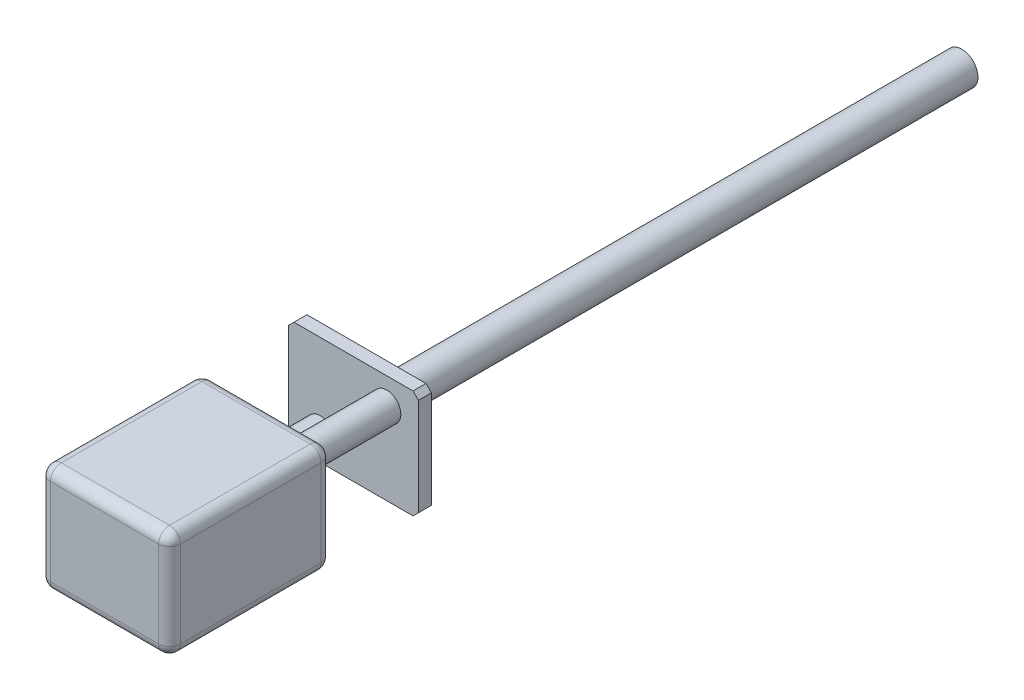
ISO-10303-21;
HEADER;
FILE_DESCRIPTION(('STEP AP214'),'2;1');
FILE_NAME('part.step','',(''),(''),'','','');
FILE_SCHEMA(('AUTOMOTIVE_DESIGN { 1 0 10303 214 1 1 1 1 }'));
ENDSEC;
DATA;
#1=APPLICATION_CONTEXT('core data for automotive mechanical design processes');
#2=APPLICATION_PROTOCOL_DEFINITION('international standard','automotive_design',2000,#1);
#3=PRODUCT_CONTEXT('',#1,'mechanical');
#4=PRODUCT('Part','Part','',(#3));
#5=PRODUCT_RELATED_PRODUCT_CATEGORY('part','',(#4));
#6=PRODUCT_DEFINITION_FORMATION('','',#4);
#7=PRODUCT_DEFINITION_CONTEXT('part definition',#1,'design');
#8=PRODUCT_DEFINITION('design','',#6,#7);
#9=PRODUCT_DEFINITION_SHAPE('','',#8);
#10=(LENGTH_UNIT() NAMED_UNIT(*) SI_UNIT(.MILLI.,.METRE.));
#11=(NAMED_UNIT(*) PLANE_ANGLE_UNIT() SI_UNIT($,.RADIAN.));
#12=(NAMED_UNIT(*) SI_UNIT($,.STERADIAN.) SOLID_ANGLE_UNIT());
#13=UNCERTAINTY_MEASURE_WITH_UNIT(LENGTH_MEASURE(1.E-05),#10,'distance_accuracy_value','');
#14=(GEOMETRIC_REPRESENTATION_CONTEXT(3) GLOBAL_UNCERTAINTY_ASSIGNED_CONTEXT((#13)) GLOBAL_UNIT_ASSIGNED_CONTEXT((#10,
#11,#12)) REPRESENTATION_CONTEXT('',''));
#15=CARTESIAN_POINT('',(0.,0.,0.));
#16=DIRECTION('',(0.,0.,1.));
#17=DIRECTION('',(1.,0.,0.));
#18=AXIS2_PLACEMENT_3D('',#15,#16,#17);
#19=CARTESIAN_POINT('',(0.,0.,15.));
#20=DIRECTION('',(1.,0.,0.));
#21=DIRECTION('',(0.,0.,-1.));
#22=AXIS2_PLACEMENT_3D('',#19,#20,#21);
#23=PLANE('',#22);
#24=DIRECTION('',(0.,-1.,0.));
#25=VECTOR('',#24,1.);
#26=CARTESIAN_POINT('',(0.,0.,1.));
#27=LINE('',#26,#25);
#28=CARTESIAN_POINT('',(0.,9.,1.));
#29=VERTEX_POINT('',#28);
#30=CARTESIAN_POINT('',(0.,1.,1.));
#31=VERTEX_POINT('',#30);
#32=EDGE_CURVE('E279',#29,#31,#27,.T.);
#33=ORIENTED_EDGE('',*,*,#32,.T.);
#34=DIRECTION('',(0.,0.,-1.));
#35=VECTOR('',#34,1.);
#36=CARTESIAN_POINT('',(0.,1.,15.));
#37=LINE('',#36,#35);
#38=CARTESIAN_POINT('',(0.,1.,14.));
#39=VERTEX_POINT('',#38);
#40=EDGE_CURVE('E283',#31,#39,#37,.F.);
#41=ORIENTED_EDGE('',*,*,#40,.T.);
#42=DIRECTION('',(0.,-1.,0.));
#43=VECTOR('',#42,1.);
#44=CARTESIAN_POINT('',(0.,0.,14.));
#45=LINE('',#44,#43);
#46=CARTESIAN_POINT('',(0.,9.,14.));
#47=VERTEX_POINT('',#46);
#48=EDGE_CURVE('E276',#39,#47,#45,.F.);
#49=ORIENTED_EDGE('',*,*,#48,.T.);
#50=DIRECTION('',(0.,0.,-1.));
#51=VECTOR('',#50,1.);
#52=CARTESIAN_POINT('',(0.,9.,15.));
#53=LINE('',#52,#51);
#54=EDGE_CURVE('E273',#47,#29,#53,.T.);
#55=ORIENTED_EDGE('',*,*,#54,.T.);
#56=EDGE_LOOP('',(#33,#41,#49,#55));
#57=FACE_BOUND('',#56,.T.);
#58=ADVANCED_FACE('F41',(#57),#23,.F.);
#59=CARTESIAN_POINT('',(0.,0.,15.));
#60=DIRECTION('',(0.,1.,0.));
#61=DIRECTION('',(0.,0.,1.));
#62=AXIS2_PLACEMENT_3D('',#59,#60,#61);
#63=PLANE('',#62);
#64=DIRECTION('',(1.,0.,0.));
#65=VECTOR('',#64,1.);
#66=CARTESIAN_POINT('',(12.,0.,1.));
#67=LINE('',#66,#65);
#68=CARTESIAN_POINT('',(1.,0.,1.));
#69=VERTEX_POINT('',#68);
#70=CARTESIAN_POINT('',(11.,0.,1.));
#71=VERTEX_POINT('',#70);
#72=EDGE_CURVE('E266',#69,#71,#67,.T.);
#73=ORIENTED_EDGE('',*,*,#72,.T.);
#74=DIRECTION('',(0.,0.,-1.));
#75=VECTOR('',#74,1.);
#76=CARTESIAN_POINT('',(11.,0.,15.));
#77=LINE('',#76,#75);
#78=CARTESIAN_POINT('',(11.,0.,14.));
#79=VERTEX_POINT('',#78);
#80=EDGE_CURVE('E270',#71,#79,#77,.F.);
#81=ORIENTED_EDGE('',*,*,#80,.T.);
#82=DIRECTION('',(1.,0.,0.));
#83=VECTOR('',#82,1.);
#84=CARTESIAN_POINT('',(0.,0.,14.));
#85=LINE('',#84,#83);
#86=CARTESIAN_POINT('',(1.,0.,14.));
#87=VERTEX_POINT('',#86);
#88=EDGE_CURVE('E263',#79,#87,#85,.F.);
#89=ORIENTED_EDGE('',*,*,#88,.T.);
#90=DIRECTION('',(0.,0.,-1.));
#91=VECTOR('',#90,1.);
#92=CARTESIAN_POINT('',(1.,0.,15.));
#93=LINE('',#92,#91);
#94=EDGE_CURVE('E260',#87,#69,#93,.T.);
#95=ORIENTED_EDGE('',*,*,#94,.T.);
#96=EDGE_LOOP('',(#73,#81,#89,#95));
#97=FACE_BOUND('',#96,.T.);
#98=ADVANCED_FACE('F424',(#97),#63,.F.);
#99=CARTESIAN_POINT('',(12.,0.,15.));
#100=DIRECTION('',(-1.,0.,0.));
#101=DIRECTION('',(0.,0.,1.));
#102=AXIS2_PLACEMENT_3D('',#99,#100,#101);
#103=PLANE('',#102);
#104=DIRECTION('',(0.,1.,0.));
#105=VECTOR('',#104,1.);
#106=CARTESIAN_POINT('',(12.,0.,14.));
#107=LINE('',#106,#105);
#108=CARTESIAN_POINT('',(12.,9.,14.));
#109=VERTEX_POINT('',#108);
#110=CARTESIAN_POINT('',(12.,1.,14.));
#111=VERTEX_POINT('',#110);
#112=EDGE_CURVE('E236',#109,#111,#107,.F.);
#113=ORIENTED_EDGE('',*,*,#112,.T.);
#114=DIRECTION('',(0.,0.,-1.));
#115=VECTOR('',#114,1.);
#116=CARTESIAN_POINT('',(12.,1.,15.));
#117=LINE('',#116,#115);
#118=CARTESIAN_POINT('',(12.,1.,1.));
#119=VERTEX_POINT('',#118);
#120=EDGE_CURVE('E244',#111,#119,#117,.T.);
#121=ORIENTED_EDGE('',*,*,#120,.T.);
#122=DIRECTION('',(0.,1.,0.));
#123=VECTOR('',#122,1.);
#124=CARTESIAN_POINT('',(12.,10.,1.));
#125=LINE('',#124,#123);
#126=CARTESIAN_POINT('',(12.,9.,1.));
#127=VERTEX_POINT('',#126);
#128=EDGE_CURVE('E240',#119,#127,#125,.T.);
#129=ORIENTED_EDGE('',*,*,#128,.T.);
#130=DIRECTION('',(0.,0.,-1.));
#131=VECTOR('',#130,1.);
#132=CARTESIAN_POINT('',(12.,9.,15.));
#133=LINE('',#132,#131);
#134=EDGE_CURVE('E233',#127,#109,#133,.F.);
#135=ORIENTED_EDGE('',*,*,#134,.T.);
#136=EDGE_LOOP('',(#113,#121,#129,#135));
#137=FACE_BOUND('',#136,.T.);
#138=ADVANCED_FACE('F430',(#137),#103,.F.);
#139=CARTESIAN_POINT('',(0.,10.,15.));
#140=DIRECTION('',(0.,-1.,0.));
#141=DIRECTION('',(0.,0.,-1.));
#142=AXIS2_PLACEMENT_3D('',#139,#140,#141);
#143=PLANE('',#142);
#144=DIRECTION('',(-1.,0.,0.));
#145=VECTOR('',#144,1.);
#146=CARTESIAN_POINT('',(0.,10.,1.));
#147=LINE('',#146,#145);
#148=CARTESIAN_POINT('',(11.,10.,1.));
#149=VERTEX_POINT('',#148);
#150=CARTESIAN_POINT('',(1.,10.,1.));
#151=VERTEX_POINT('',#150);
#152=EDGE_CURVE('E292',#149,#151,#147,.T.);
#153=ORIENTED_EDGE('',*,*,#152,.T.);
#154=DIRECTION('',(0.,0.,-1.));
#155=VECTOR('',#154,1.);
#156=CARTESIAN_POINT('',(1.,10.,15.));
#157=LINE('',#156,#155);
#158=CARTESIAN_POINT('',(1.,10.,14.));
#159=VERTEX_POINT('',#158);
#160=EDGE_CURVE('E296',#151,#159,#157,.F.);
#161=ORIENTED_EDGE('',*,*,#160,.T.);
#162=DIRECTION('',(-1.,0.,0.));
#163=VECTOR('',#162,1.);
#164=CARTESIAN_POINT('',(0.,10.,14.));
#165=LINE('',#164,#163);
#166=CARTESIAN_POINT('',(11.,10.,14.));
#167=VERTEX_POINT('',#166);
#168=EDGE_CURVE('E289',#159,#167,#165,.F.);
#169=ORIENTED_EDGE('',*,*,#168,.T.);
#170=DIRECTION('',(0.,0.,-1.));
#171=VECTOR('',#170,1.);
#172=CARTESIAN_POINT('',(11.,10.,15.));
#173=LINE('',#172,#171);
#174=EDGE_CURVE('E286',#167,#149,#173,.T.);
#175=ORIENTED_EDGE('',*,*,#174,.T.);
#176=EDGE_LOOP('',(#153,#161,#169,#175));
#177=FACE_BOUND('',#176,.T.);
#178=ADVANCED_FACE('F546',(#177),#143,.F.);
#179=CARTESIAN_POINT('',(0.,0.,15.));
#180=DIRECTION('',(0.,0.,-1.));
#181=DIRECTION('',(-1.,0.,0.));
#182=AXIS2_PLACEMENT_3D('',#179,#180,#181);
#183=PLANE('',#182);
#184=DIRECTION('',(1.,0.,0.));
#185=VECTOR('',#184,1.);
#186=CARTESIAN_POINT('',(0.,1.,15.));
#187=LINE('',#186,#185);
#188=CARTESIAN_POINT('',(1.,1.,15.));
#189=VERTEX_POINT('',#188);
#190=CARTESIAN_POINT('',(11.,1.,15.));
#191=VERTEX_POINT('',#190);
#192=EDGE_CURVE('E299',#189,#191,#187,.T.);
#193=ORIENTED_EDGE('',*,*,#192,.T.);
#194=DIRECTION('',(0.,1.,0.));
#195=VECTOR('',#194,1.);
#196=CARTESIAN_POINT('',(11.,0.,15.));
#197=LINE('',#196,#195);
#198=CARTESIAN_POINT('',(11.,9.,15.));
#199=VERTEX_POINT('',#198);
#200=EDGE_CURVE('E307',#191,#199,#197,.T.);
#201=ORIENTED_EDGE('',*,*,#200,.T.);
#202=DIRECTION('',(-1.,0.,0.));
#203=VECTOR('',#202,1.);
#204=CARTESIAN_POINT('',(0.,9.,15.));
#205=LINE('',#204,#203);
#206=CARTESIAN_POINT('',(1.,9.,15.));
#207=VERTEX_POINT('',#206);
#208=EDGE_CURVE('E65',#199,#207,#205,.T.);
#209=ORIENTED_EDGE('',*,*,#208,.T.);
#210=DIRECTION('',(0.,-1.,0.));
#211=VECTOR('',#210,1.);
#212=CARTESIAN_POINT('',(1.,0.,15.));
#213=LINE('',#212,#211);
#214=EDGE_CURVE('E302',#207,#189,#213,.T.);
#215=ORIENTED_EDGE('',*,*,#214,.T.);
#216=EDGE_LOOP('',(#193,#201,#209,#215));
#217=FACE_BOUND('',#216,.T.);
#218=ADVANCED_FACE('F419',(#217),#183,.F.);
#219=CARTESIAN_POINT('',(0.,0.,0.));
#220=DIRECTION('',(0.,0.,-1.));
#221=DIRECTION('',(-1.,0.,0.));
#222=AXIS2_PLACEMENT_3D('',#219,#220,#221);
#223=PLANE('',#222);
#224=CARTESIAN_POINT('',(9.0728851183895,7.56073759865792,0.));
#225=DIRECTION('',(0.,0.,-1.));
#226=DIRECTION('',(-1.,0.,0.));
#227=AXIS2_PLACEMENT_3D('',#224,#225,#226);
#228=CIRCLE('',#227,1.3);
#229=CARTESIAN_POINT('',(7.7728851183895,7.56073759865792,0.));
#230=VERTEX_POINT('',#229);
#231=EDGE_CURVE('E210',#230,#230,#228,.T.);
#232=ORIENTED_EDGE('',*,*,#231,.F.);
#233=EDGE_LOOP('',(#232));
#234=FACE_BOUND('',#233,.T.);
#235=CARTESIAN_POINT('',(2.9271148816105,2.43926240134208,0.));
#236=DIRECTION('',(0.,0.,-1.));
#237=DIRECTION('',(-1.,0.,0.));
#238=AXIS2_PLACEMENT_3D('',#235,#236,#237);
#239=CIRCLE('',#238,1.3);
#240=CARTESIAN_POINT('',(1.6271148816105,2.43926240134208,0.));
#241=VERTEX_POINT('',#240);
#242=EDGE_CURVE('E223',#241,#241,#239,.T.);
#243=ORIENTED_EDGE('',*,*,#242,.F.);
#244=EDGE_LOOP('',(#243));
#245=FACE_BOUND('',#244,.T.);
#246=DIRECTION('',(-1.,0.,0.));
#247=VECTOR('',#246,1.);
#248=CARTESIAN_POINT('',(12.,9.,0.));
#249=LINE('',#248,#247);
#250=CARTESIAN_POINT('',(1.,9.,0.));
#251=VERTEX_POINT('',#250);
#252=CARTESIAN_POINT('',(11.,9.,0.));
#253=VERTEX_POINT('',#252);
#254=EDGE_CURVE('E247',#251,#253,#249,.F.);
#255=ORIENTED_EDGE('',*,*,#254,.T.);
#256=DIRECTION('',(0.,1.,0.));
#257=VECTOR('',#256,1.);
#258=CARTESIAN_POINT('',(11.,0.,0.));
#259=LINE('',#258,#257);
#260=CARTESIAN_POINT('',(11.,1.,0.));
#261=VERTEX_POINT('',#260);
#262=EDGE_CURVE('E256',#253,#261,#259,.F.);
#263=ORIENTED_EDGE('',*,*,#262,.T.);
#264=DIRECTION('',(1.,0.,0.));
#265=VECTOR('',#264,1.);
#266=CARTESIAN_POINT('',(0.,1.,0.));
#267=LINE('',#266,#265);
#268=CARTESIAN_POINT('',(1.,1.,0.));
#269=VERTEX_POINT('',#268);
#270=EDGE_CURVE('E253',#261,#269,#267,.F.);
#271=ORIENTED_EDGE('',*,*,#270,.T.);
#272=DIRECTION('',(0.,-1.,0.));
#273=VECTOR('',#272,1.);
#274=CARTESIAN_POINT('',(1.,10.,0.));
#275=LINE('',#274,#273);
#276=EDGE_CURVE('E250',#269,#251,#275,.F.);
#277=ORIENTED_EDGE('',*,*,#276,.T.);
#278=EDGE_LOOP('',(#255,#263,#271,#277));
#279=FACE_BOUND('',#278,.T.);
#280=ADVANCED_FACE('F406',(#234,#245,#279),#223,.T.);
#281=CARTESIAN_POINT('',(1.,0.,14.));
#282=DIRECTION('',(0.,-1.,0.));
#283=DIRECTION('',(0.,0.,-1.));
#284=AXIS2_PLACEMENT_3D('',#281,#282,#283);
#285=CYLINDRICAL_SURFACE('',#284,1.);
#286=CARTESIAN_POINT('',(1.,1.,14.));
#287=DIRECTION('',(0.,-1.,0.));
#288=DIRECTION('',(0.,0.,-1.));
#289=AXIS2_PLACEMENT_3D('',#286,#287,#288);
#290=CIRCLE('',#289,1.);
#291=EDGE_CURVE('E237',#189,#39,#290,.T.);
#292=ORIENTED_EDGE('',*,*,#291,.F.);
#293=ORIENTED_EDGE('',*,*,#214,.F.);
#294=CARTESIAN_POINT('',(1.,9.,14.));
#295=DIRECTION('',(0.,1.,0.));
#296=DIRECTION('',(0.,0.,1.));
#297=AXIS2_PLACEMENT_3D('',#294,#295,#296);
#298=CIRCLE('',#297,1.);
#299=EDGE_CURVE('E389',#47,#207,#298,.T.);
#300=ORIENTED_EDGE('',*,*,#299,.F.);
#301=ORIENTED_EDGE('',*,*,#48,.F.);
#302=EDGE_LOOP('',(#292,#293,#300,#301));
#303=FACE_BOUND('',#302,.T.);
#304=ADVANCED_FACE('F43',(#303),#285,.T.);
#305=CARTESIAN_POINT('',(1.,1.,14.));
#306=DIRECTION('',(0.,0.,1.));
#307=DIRECTION('',(1.,0.,0.));
#308=AXIS2_PLACEMENT_3D('',#305,#306,#307);
#309=SPHERICAL_SURFACE('',#308,1.);
#310=CARTESIAN_POINT('',(1.,1.,14.));
#311=DIRECTION('',(-1.,0.,0.));
#312=DIRECTION('',(0.,0.,1.));
#313=AXIS2_PLACEMENT_3D('',#310,#311,#312);
#314=CIRCLE('',#313,1.);
#315=EDGE_CURVE('E381',#189,#87,#314,.F.);
#316=ORIENTED_EDGE('',*,*,#315,.F.);
#317=ORIENTED_EDGE('',*,*,#291,.T.);
#318=CARTESIAN_POINT('',(1.,1.,14.));
#319=DIRECTION('',(0.,0.,1.));
#320=DIRECTION('',(1.,0.,0.));
#321=AXIS2_PLACEMENT_3D('',#318,#319,#320);
#322=CIRCLE('',#321,1.);
#323=EDGE_CURVE('E385',#87,#39,#322,.F.);
#324=ORIENTED_EDGE('',*,*,#323,.F.);
#325=EDGE_LOOP('',(#316,#317,#324));
#326=FACE_BOUND('',#325,.T.);
#327=ADVANCED_FACE('F505',(#326),#309,.T.);
#328=CARTESIAN_POINT('',(1.,9.,14.));
#329=DIRECTION('',(0.,0.,1.));
#330=DIRECTION('',(1.,0.,0.));
#331=AXIS2_PLACEMENT_3D('',#328,#329,#330);
#332=SPHERICAL_SURFACE('',#331,1.);
#333=CARTESIAN_POINT('',(1.,9.,14.));
#334=DIRECTION('',(0.,0.,1.));
#335=DIRECTION('',(1.,0.,0.));
#336=AXIS2_PLACEMENT_3D('',#333,#334,#335);
#337=CIRCLE('',#336,1.);
#338=EDGE_CURVE('E373',#47,#159,#337,.F.);
#339=ORIENTED_EDGE('',*,*,#338,.F.);
#340=ORIENTED_EDGE('',*,*,#299,.T.);
#341=CARTESIAN_POINT('',(1.,9.,14.));
#342=DIRECTION('',(-1.,0.,0.));
#343=DIRECTION('',(0.,0.,1.));
#344=AXIS2_PLACEMENT_3D('',#341,#342,#343);
#345=CIRCLE('',#344,1.);
#346=EDGE_CURVE('E377',#159,#207,#345,.F.);
#347=ORIENTED_EDGE('',*,*,#346,.F.);
#348=EDGE_LOOP('',(#339,#340,#347));
#349=FACE_BOUND('',#348,.T.);
#350=ADVANCED_FACE('F502',(#349),#332,.T.);
#351=CARTESIAN_POINT('',(1.,1.,15.));
#352=DIRECTION('',(0.,0.,-1.));
#353=DIRECTION('',(-1.,0.,0.));
#354=AXIS2_PLACEMENT_3D('',#351,#352,#353);
#355=CYLINDRICAL_SURFACE('',#354,1.);
#356=ORIENTED_EDGE('',*,*,#323,.T.);
#357=ORIENTED_EDGE('',*,*,#40,.F.);
#358=CARTESIAN_POINT('',(1.,1.,1.));
#359=DIRECTION('',(0.,0.,-1.));
#360=DIRECTION('',(-1.,0.,0.));
#361=AXIS2_PLACEMENT_3D('',#358,#359,#360);
#362=CIRCLE('',#361,1.);
#363=EDGE_CURVE('E366',#69,#31,#362,.T.);
#364=ORIENTED_EDGE('',*,*,#363,.F.);
#365=ORIENTED_EDGE('',*,*,#94,.F.);
#366=EDGE_LOOP('',(#356,#357,#364,#365));
#367=FACE_BOUND('',#366,.T.);
#368=ADVANCED_FACE('F498',(#367),#355,.T.);
#369=CARTESIAN_POINT('',(0.,1.,14.));
#370=DIRECTION('',(1.,0.,0.));
#371=DIRECTION('',(0.,0.,-1.));
#372=AXIS2_PLACEMENT_3D('',#369,#370,#371);
#373=CYLINDRICAL_SURFACE('',#372,1.);
#374=ORIENTED_EDGE('',*,*,#315,.T.);
#375=ORIENTED_EDGE('',*,*,#88,.F.);
#376=CARTESIAN_POINT('',(11.,1.,14.));
#377=DIRECTION('',(1.,0.,0.));
#378=DIRECTION('',(0.,0.,-1.));
#379=AXIS2_PLACEMENT_3D('',#376,#377,#378);
#380=CIRCLE('',#379,1.);
#381=EDGE_CURVE('E362',#191,#79,#380,.T.);
#382=ORIENTED_EDGE('',*,*,#381,.F.);
#383=ORIENTED_EDGE('',*,*,#192,.F.);
#384=EDGE_LOOP('',(#374,#375,#382,#383));
#385=FACE_BOUND('',#384,.T.);
#386=ADVANCED_FACE('F494',(#385),#373,.T.);
#387=CARTESIAN_POINT('',(11.,0.,14.));
#388=DIRECTION('',(0.,1.,0.));
#389=DIRECTION('',(0.,0.,1.));
#390=AXIS2_PLACEMENT_3D('',#387,#388,#389);
#391=CYLINDRICAL_SURFACE('',#390,1.);
#392=CARTESIAN_POINT('',(11.,9.,14.));
#393=DIRECTION('',(0.,1.,0.));
#394=DIRECTION('',(0.,0.,1.));
#395=AXIS2_PLACEMENT_3D('',#392,#393,#394);
#396=CIRCLE('',#395,1.);
#397=EDGE_CURVE('E355',#199,#109,#396,.T.);
#398=ORIENTED_EDGE('',*,*,#397,.F.);
#399=ORIENTED_EDGE('',*,*,#200,.F.);
#400=CARTESIAN_POINT('',(11.,1.,14.));
#401=DIRECTION('',(0.,-1.,0.));
#402=DIRECTION('',(0.,0.,-1.));
#403=AXIS2_PLACEMENT_3D('',#400,#401,#402);
#404=CIRCLE('',#403,1.);
#405=EDGE_CURVE('E358',#111,#191,#404,.T.);
#406=ORIENTED_EDGE('',*,*,#405,.F.);
#407=ORIENTED_EDGE('',*,*,#112,.F.);
#408=EDGE_LOOP('',(#398,#399,#406,#407));
#409=FACE_BOUND('',#408,.T.);
#410=ADVANCED_FACE('F490',(#409),#391,.T.);
#411=CARTESIAN_POINT('',(0.,9.,14.));
#412=DIRECTION('',(-1.,0.,0.));
#413=DIRECTION('',(0.,0.,1.));
#414=AXIS2_PLACEMENT_3D('',#411,#412,#413);
#415=CYLINDRICAL_SURFACE('',#414,1.);
#416=ORIENTED_EDGE('',*,*,#346,.T.);
#417=ORIENTED_EDGE('',*,*,#208,.F.);
#418=CARTESIAN_POINT('',(11.,9.,14.));
#419=DIRECTION('',(1.,0.,0.));
#420=DIRECTION('',(0.,0.,-1.));
#421=AXIS2_PLACEMENT_3D('',#418,#419,#420);
#422=CIRCLE('',#421,1.);
#423=EDGE_CURVE('E57',#167,#199,#422,.T.);
#424=ORIENTED_EDGE('',*,*,#423,.F.);
#425=ORIENTED_EDGE('',*,*,#168,.F.);
#426=EDGE_LOOP('',(#416,#417,#424,#425));
#427=FACE_BOUND('',#426,.T.);
#428=ADVANCED_FACE('F486',(#427),#415,.T.);
#429=CARTESIAN_POINT('',(1.,9.,15.));
#430=DIRECTION('',(0.,0.,-1.));
#431=DIRECTION('',(-1.,0.,0.));
#432=AXIS2_PLACEMENT_3D('',#429,#430,#431);
#433=CYLINDRICAL_SURFACE('',#432,1.);
#434=ORIENTED_EDGE('',*,*,#338,.T.);
#435=ORIENTED_EDGE('',*,*,#160,.F.);
#436=CARTESIAN_POINT('',(1.,9.,1.));
#437=DIRECTION('',(0.,0.,-1.));
#438=DIRECTION('',(-1.,0.,0.));
#439=AXIS2_PLACEMENT_3D('',#436,#437,#438);
#440=CIRCLE('',#439,1.);
#441=EDGE_CURVE('E349',#29,#151,#440,.T.);
#442=ORIENTED_EDGE('',*,*,#441,.F.);
#443=ORIENTED_EDGE('',*,*,#54,.F.);
#444=EDGE_LOOP('',(#434,#435,#442,#443));
#445=FACE_BOUND('',#444,.T.);
#446=ADVANCED_FACE('F482',(#445),#433,.T.);
#447=CARTESIAN_POINT('',(1.,0.,1.));
#448=DIRECTION('',(0.,1.,0.));
#449=DIRECTION('',(0.,0.,1.));
#450=AXIS2_PLACEMENT_3D('',#447,#448,#449);
#451=CYLINDRICAL_SURFACE('',#450,1.);
#452=CARTESIAN_POINT('',(1.,1.,1.));
#453=DIRECTION('',(0.,-1.,0.));
#454=DIRECTION('',(0.,0.,-1.));
#455=AXIS2_PLACEMENT_3D('',#452,#453,#454);
#456=CIRCLE('',#455,1.);
#457=EDGE_CURVE('E369',#31,#269,#456,.T.);
#458=ORIENTED_EDGE('',*,*,#457,.F.);
#459=ORIENTED_EDGE('',*,*,#32,.F.);
#460=CARTESIAN_POINT('',(1.,9.,1.));
#461=DIRECTION('',(0.,1.,0.));
#462=DIRECTION('',(0.,0.,1.));
#463=AXIS2_PLACEMENT_3D('',#460,#461,#462);
#464=CIRCLE('',#463,1.);
#465=EDGE_CURVE('E345',#251,#29,#464,.T.);
#466=ORIENTED_EDGE('',*,*,#465,.F.);
#467=ORIENTED_EDGE('',*,*,#276,.F.);
#468=EDGE_LOOP('',(#458,#459,#466,#467));
#469=FACE_BOUND('',#468,.T.);
#470=ADVANCED_FACE('F478',(#469),#451,.T.);
#471=CARTESIAN_POINT('',(1.,1.,1.));
#472=DIRECTION('',(0.,0.,1.));
#473=DIRECTION('',(1.,0.,0.));
#474=AXIS2_PLACEMENT_3D('',#471,#472,#473);
#475=SPHERICAL_SURFACE('',#474,1.);
#476=ORIENTED_EDGE('',*,*,#363,.T.);
#477=ORIENTED_EDGE('',*,*,#457,.T.);
#478=CARTESIAN_POINT('',(1.,1.,1.));
#479=DIRECTION('',(-1.,0.,0.));
#480=DIRECTION('',(0.,0.,1.));
#481=AXIS2_PLACEMENT_3D('',#478,#479,#480);
#482=CIRCLE('',#481,1.);
#483=EDGE_CURVE('E341',#69,#269,#482,.F.);
#484=ORIENTED_EDGE('',*,*,#483,.F.);
#485=EDGE_LOOP('',(#476,#477,#484));
#486=FACE_BOUND('',#485,.T.);
#487=ADVANCED_FACE('F474',(#486),#475,.T.);
#488=CARTESIAN_POINT('',(11.,1.,14.));
#489=DIRECTION('',(0.,0.,1.));
#490=DIRECTION('',(1.,0.,0.));
#491=AXIS2_PLACEMENT_3D('',#488,#489,#490);
#492=SPHERICAL_SURFACE('',#491,1.);
#493=ORIENTED_EDGE('',*,*,#405,.T.);
#494=ORIENTED_EDGE('',*,*,#381,.T.);
#495=CARTESIAN_POINT('',(11.,1.,14.));
#496=DIRECTION('',(0.,0.,1.));
#497=DIRECTION('',(1.,0.,0.));
#498=AXIS2_PLACEMENT_3D('',#495,#496,#497);
#499=CIRCLE('',#498,1.);
#500=EDGE_CURVE('E337',#111,#79,#499,.F.);
#501=ORIENTED_EDGE('',*,*,#500,.F.);
#502=EDGE_LOOP('',(#493,#494,#501));
#503=FACE_BOUND('',#502,.T.);
#504=ADVANCED_FACE('F471',(#503),#492,.T.);
#505=CARTESIAN_POINT('',(11.,9.,14.));
#506=DIRECTION('',(0.,0.,1.));
#507=DIRECTION('',(1.,0.,0.));
#508=AXIS2_PLACEMENT_3D('',#505,#506,#507);
#509=SPHERICAL_SURFACE('',#508,1.);
#510=ORIENTED_EDGE('',*,*,#423,.T.);
#511=ORIENTED_EDGE('',*,*,#397,.T.);
#512=CARTESIAN_POINT('',(11.,9.,14.));
#513=DIRECTION('',(0.,0.,1.));
#514=DIRECTION('',(1.,0.,0.));
#515=AXIS2_PLACEMENT_3D('',#512,#513,#514);
#516=CIRCLE('',#515,1.);
#517=EDGE_CURVE('E333',#167,#109,#516,.F.);
#518=ORIENTED_EDGE('',*,*,#517,.F.);
#519=EDGE_LOOP('',(#510,#511,#518));
#520=FACE_BOUND('',#519,.T.);
#521=ADVANCED_FACE('F467',(#520),#509,.T.);
#522=CARTESIAN_POINT('',(1.,9.,1.));
#523=DIRECTION('',(0.,0.,1.));
#524=DIRECTION('',(1.,0.,0.));
#525=AXIS2_PLACEMENT_3D('',#522,#523,#524);
#526=SPHERICAL_SURFACE('',#525,1.);
#527=ORIENTED_EDGE('',*,*,#465,.T.);
#528=ORIENTED_EDGE('',*,*,#441,.T.);
#529=CARTESIAN_POINT('',(1.,9.,1.));
#530=DIRECTION('',(-1.,0.,0.));
#531=DIRECTION('',(0.,0.,1.));
#532=AXIS2_PLACEMENT_3D('',#529,#530,#531);
#533=CIRCLE('',#532,1.);
#534=EDGE_CURVE('E330',#251,#151,#533,.F.);
#535=ORIENTED_EDGE('',*,*,#534,.F.);
#536=EDGE_LOOP('',(#527,#528,#535));
#537=FACE_BOUND('',#536,.T.);
#538=ADVANCED_FACE('F463',(#537),#526,.T.);
#539=CARTESIAN_POINT('',(0.,1.,1.));
#540=DIRECTION('',(-1.,0.,0.));
#541=DIRECTION('',(0.,0.,1.));
#542=AXIS2_PLACEMENT_3D('',#539,#540,#541);
#543=CYLINDRICAL_SURFACE('',#542,1.);
#544=ORIENTED_EDGE('',*,*,#483,.T.);
#545=ORIENTED_EDGE('',*,*,#270,.F.);
#546=CARTESIAN_POINT('',(11.,1.,1.));
#547=DIRECTION('',(1.,0.,0.));
#548=DIRECTION('',(0.,0.,-1.));
#549=AXIS2_PLACEMENT_3D('',#546,#547,#548);
#550=CIRCLE('',#549,1.);
#551=EDGE_CURVE('E326',#71,#261,#550,.T.);
#552=ORIENTED_EDGE('',*,*,#551,.F.);
#553=ORIENTED_EDGE('',*,*,#72,.F.);
#554=EDGE_LOOP('',(#544,#545,#552,#553));
#555=FACE_BOUND('',#554,.T.);
#556=ADVANCED_FACE('F459',(#555),#543,.T.);
#557=CARTESIAN_POINT('',(11.,1.,15.));
#558=DIRECTION('',(0.,0.,-1.));
#559=DIRECTION('',(-1.,0.,0.));
#560=AXIS2_PLACEMENT_3D('',#557,#558,#559);
#561=CYLINDRICAL_SURFACE('',#560,1.);
#562=ORIENTED_EDGE('',*,*,#500,.T.);
#563=ORIENTED_EDGE('',*,*,#80,.F.);
#564=CARTESIAN_POINT('',(11.,1.,1.));
#565=DIRECTION('',(0.,0.,-1.));
#566=DIRECTION('',(-1.,0.,0.));
#567=AXIS2_PLACEMENT_3D('',#564,#565,#566);
#568=CIRCLE('',#567,1.);
#569=EDGE_CURVE('E323',#119,#71,#568,.T.);
#570=ORIENTED_EDGE('',*,*,#569,.F.);
#571=ORIENTED_EDGE('',*,*,#120,.F.);
#572=EDGE_LOOP('',(#562,#563,#570,#571));
#573=FACE_BOUND('',#572,.T.);
#574=ADVANCED_FACE('F455',(#573),#561,.T.);
#575=CARTESIAN_POINT('',(11.,9.,15.));
#576=DIRECTION('',(0.,0.,-1.));
#577=DIRECTION('',(-1.,0.,0.));
#578=AXIS2_PLACEMENT_3D('',#575,#576,#577);
#579=CYLINDRICAL_SURFACE('',#578,1.);
#580=ORIENTED_EDGE('',*,*,#517,.T.);
#581=ORIENTED_EDGE('',*,*,#134,.F.);
#582=CARTESIAN_POINT('',(11.,9.,1.));
#583=DIRECTION('',(0.,0.,-1.));
#584=DIRECTION('',(-1.,0.,0.));
#585=AXIS2_PLACEMENT_3D('',#582,#583,#584);
#586=CIRCLE('',#585,1.);
#587=EDGE_CURVE('E319',#149,#127,#586,.T.);
#588=ORIENTED_EDGE('',*,*,#587,.F.);
#589=ORIENTED_EDGE('',*,*,#174,.F.);
#590=EDGE_LOOP('',(#580,#581,#588,#589));
#591=FACE_BOUND('',#590,.T.);
#592=ADVANCED_FACE('F451',(#591),#579,.T.);
#593=CARTESIAN_POINT('',(0.,9.,1.));
#594=DIRECTION('',(1.,0.,0.));
#595=DIRECTION('',(0.,0.,-1.));
#596=AXIS2_PLACEMENT_3D('',#593,#594,#595);
#597=CYLINDRICAL_SURFACE('',#596,1.);
#598=ORIENTED_EDGE('',*,*,#534,.T.);
#599=ORIENTED_EDGE('',*,*,#152,.F.);
#600=CARTESIAN_POINT('',(11.,9.,1.));
#601=DIRECTION('',(1.,0.,0.));
#602=DIRECTION('',(0.,0.,-1.));
#603=AXIS2_PLACEMENT_3D('',#600,#601,#602);
#604=CIRCLE('',#603,1.);
#605=EDGE_CURVE('E315',#253,#149,#604,.T.);
#606=ORIENTED_EDGE('',*,*,#605,.F.);
#607=ORIENTED_EDGE('',*,*,#254,.F.);
#608=EDGE_LOOP('',(#598,#599,#606,#607));
#609=FACE_BOUND('',#608,.T.);
#610=ADVANCED_FACE('F447',(#609),#597,.T.);
#611=CARTESIAN_POINT('',(11.,1.,1.));
#612=DIRECTION('',(0.,0.,1.));
#613=DIRECTION('',(1.,0.,0.));
#614=AXIS2_PLACEMENT_3D('',#611,#612,#613);
#615=SPHERICAL_SURFACE('',#614,1.);
#616=ORIENTED_EDGE('',*,*,#569,.T.);
#617=ORIENTED_EDGE('',*,*,#551,.T.);
#618=CARTESIAN_POINT('',(11.,1.,1.));
#619=DIRECTION('',(0.,-1.,0.));
#620=DIRECTION('',(0.,0.,-1.));
#621=AXIS2_PLACEMENT_3D('',#618,#619,#620);
#622=CIRCLE('',#621,1.);
#623=EDGE_CURVE('E312',#119,#261,#622,.F.);
#624=ORIENTED_EDGE('',*,*,#623,.F.);
#625=EDGE_LOOP('',(#616,#617,#624));
#626=FACE_BOUND('',#625,.T.);
#627=ADVANCED_FACE('F443',(#626),#615,.T.);
#628=CARTESIAN_POINT('',(11.,9.,1.));
#629=DIRECTION('',(0.,0.,1.));
#630=DIRECTION('',(1.,0.,0.));
#631=AXIS2_PLACEMENT_3D('',#628,#629,#630);
#632=SPHERICAL_SURFACE('',#631,1.);
#633=ORIENTED_EDGE('',*,*,#605,.T.);
#634=ORIENTED_EDGE('',*,*,#587,.T.);
#635=CARTESIAN_POINT('',(11.,9.,1.));
#636=DIRECTION('',(0.,1.,0.));
#637=DIRECTION('',(0.,0.,1.));
#638=AXIS2_PLACEMENT_3D('',#635,#636,#637);
#639=CIRCLE('',#638,1.);
#640=EDGE_CURVE('E229',#253,#127,#639,.F.);
#641=ORIENTED_EDGE('',*,*,#640,.F.);
#642=EDGE_LOOP('',(#633,#634,#641));
#643=FACE_BOUND('',#642,.T.);
#644=ADVANCED_FACE('F439',(#643),#632,.T.);
#645=CARTESIAN_POINT('',(11.,0.,1.));
#646=DIRECTION('',(0.,-1.,0.));
#647=DIRECTION('',(0.,0.,-1.));
#648=AXIS2_PLACEMENT_3D('',#645,#646,#647);
#649=CYLINDRICAL_SURFACE('',#648,1.);
#650=ORIENTED_EDGE('',*,*,#623,.T.);
#651=ORIENTED_EDGE('',*,*,#262,.F.);
#652=ORIENTED_EDGE('',*,*,#640,.T.);
#653=ORIENTED_EDGE('',*,*,#128,.F.);
#654=EDGE_LOOP('',(#650,#651,#652,#653));
#655=FACE_BOUND('',#654,.T.);
#656=ADVANCED_FACE('F435',(#655),#649,.T.);
#657=CARTESIAN_POINT('',(2.9271148816105,2.43926240134208,-8.));
#658=DIRECTION('',(0.,0.,1.));
#659=DIRECTION('',(1.,0.,0.));
#660=AXIS2_PLACEMENT_3D('',#657,#658,#659);
#661=CYLINDRICAL_SURFACE('',#660,1.3);
#662=CARTESIAN_POINT('',(2.9271148816105,2.43926240134208,-8.));
#663=DIRECTION('',(0.,0.,-1.));
#664=DIRECTION('',(-1.,0.,0.));
#665=AXIS2_PLACEMENT_3D('',#662,#663,#664);
#666=CIRCLE('',#665,1.3);
#667=CARTESIAN_POINT('',(1.6271148816105,2.43926240134208,-8.));
#668=VERTEX_POINT('',#667);
#669=EDGE_CURVE('E225',#668,#668,#666,.T.);
#670=ORIENTED_EDGE('',*,*,#669,.F.);
#671=EDGE_LOOP('',(#670));
#672=FACE_BOUND('',#671,.T.);
#673=ORIENTED_EDGE('',*,*,#242,.T.);
#674=EDGE_LOOP('',(#673));
#675=FACE_BOUND('',#674,.T.);
#676=ADVANCED_FACE('F438',(#672,#675),#661,.T.);
#677=CARTESIAN_POINT('',(9.0728851183895,7.56073759865792,-8.));
#678=DIRECTION('',(0.,0.,1.));
#679=DIRECTION('',(1.,0.,0.));
#680=AXIS2_PLACEMENT_3D('',#677,#678,#679);
#681=CYLINDRICAL_SURFACE('',#680,1.3);
#682=CARTESIAN_POINT('',(9.0728851183895,7.56073759865792,-8.));
#683=DIRECTION('',(0.,0.,-1.));
#684=DIRECTION('',(-1.,0.,0.));
#685=AXIS2_PLACEMENT_3D('',#682,#683,#684);
#686=CIRCLE('',#685,1.3);
#687=CARTESIAN_POINT('',(7.7728851183895,7.56073759865792,-8.));
#688=VERTEX_POINT('',#687);
#689=EDGE_CURVE('E215',#688,#688,#686,.T.);
#690=ORIENTED_EDGE('',*,*,#689,.F.);
#691=EDGE_LOOP('',(#690));
#692=FACE_BOUND('',#691,.T.);
#693=ORIENTED_EDGE('',*,*,#231,.T.);
#694=EDGE_LOOP('',(#693));
#695=FACE_BOUND('',#694,.T.);
#696=ADVANCED_FACE('F711',(#692,#695),#681,.T.);
#697=CARTESIAN_POINT('',(0.,0.,-8.));
#698=DIRECTION('',(0.,0.,1.));
#699=DIRECTION('',(1.,0.,0.));
#700=AXIS2_PLACEMENT_3D('',#697,#698,#699);
#701=PLANE('',#700);
#702=ORIENTED_EDGE('',*,*,#669,.T.);
#703=EDGE_LOOP('',(#702));
#704=FACE_BOUND('',#703,.T.);
#705=ORIENTED_EDGE('',*,*,#689,.T.);
#706=EDGE_LOOP('',(#705));
#707=FACE_BOUND('',#706,.T.);
#708=DIRECTION('',(-1.,0.,0.));
#709=VECTOR('',#708,1.);
#710=CARTESIAN_POINT('',(0.5,0.,-8.));
#711=LINE('',#710,#709);
#712=CARTESIAN_POINT('',(11.5,0.,-8.));
#713=VERTEX_POINT('',#712);
#714=CARTESIAN_POINT('',(0.5,0.,-8.));
#715=VERTEX_POINT('',#714);
#716=EDGE_CURVE('E208',#713,#715,#711,.T.);
#717=ORIENTED_EDGE('',*,*,#716,.F.);
#718=DIRECTION('',(-0.707106781186548,-0.707106781186547,0.));
#719=VECTOR('',#718,1.);
#720=CARTESIAN_POINT('',(11.5,0.,-8.));
#721=LINE('',#720,#719);
#722=CARTESIAN_POINT('',(12.,0.5,-8.));
#723=VERTEX_POINT('',#722);
#724=EDGE_CURVE('E204',#723,#713,#721,.T.);
#725=ORIENTED_EDGE('',*,*,#724,.F.);
#726=DIRECTION('',(0.,-1.,0.));
#727=VECTOR('',#726,1.);
#728=CARTESIAN_POINT('',(12.,0.5,-8.));
#729=LINE('',#728,#727);
#730=CARTESIAN_POINT('',(12.,9.5,-8.));
#731=VERTEX_POINT('',#730);
#732=EDGE_CURVE('E902',#731,#723,#729,.T.);
#733=ORIENTED_EDGE('',*,*,#732,.F.);
#734=DIRECTION('',(0.707106781186547,-0.707106781186547,0.));
#735=VECTOR('',#734,1.);
#736=CARTESIAN_POINT('',(12.,9.5,-8.));
#737=LINE('',#736,#735);
#738=CARTESIAN_POINT('',(11.5,10.,-8.));
#739=VERTEX_POINT('',#738);
#740=EDGE_CURVE('E899',#739,#731,#737,.T.);
#741=ORIENTED_EDGE('',*,*,#740,.F.);
#742=DIRECTION('',(1.,0.,0.));
#743=VECTOR('',#742,1.);
#744=CARTESIAN_POINT('',(0.5,10.,-8.));
#745=LINE('',#744,#743);
#746=CARTESIAN_POINT('',(0.5,10.,-8.));
#747=VERTEX_POINT('',#746);
#748=EDGE_CURVE('E896',#747,#739,#745,.T.);
#749=ORIENTED_EDGE('',*,*,#748,.F.);
#750=DIRECTION('',(0.707106781186547,0.707106781186548,0.));
#751=VECTOR('',#750,1.);
#752=CARTESIAN_POINT('',(0.,9.5,-8.));
#753=LINE('',#752,#751);
#754=CARTESIAN_POINT('',(0.,9.5,-8.));
#755=VERTEX_POINT('',#754);
#756=EDGE_CURVE('E893',#755,#747,#753,.T.);
#757=ORIENTED_EDGE('',*,*,#756,.F.);
#758=DIRECTION('',(0.,1.,0.));
#759=VECTOR('',#758,1.);
#760=CARTESIAN_POINT('',(0.,0.5,-8.));
#761=LINE('',#760,#759);
#762=CARTESIAN_POINT('',(0.,0.5,-8.));
#763=VERTEX_POINT('',#762);
#764=EDGE_CURVE('E890',#763,#755,#761,.T.);
#765=ORIENTED_EDGE('',*,*,#764,.F.);
#766=DIRECTION('',(-0.707106781186548,0.707106781186548,0.));
#767=VECTOR('',#766,1.);
#768=CARTESIAN_POINT('',(0.,0.5,-8.));
#769=LINE('',#768,#767);
#770=EDGE_CURVE('E887',#715,#763,#769,.T.);
#771=ORIENTED_EDGE('',*,*,#770,.F.);
#772=EDGE_LOOP('',(#717,#725,#733,#741,#749,#757,#765,#771));
#773=FACE_BOUND('',#772,.T.);
#774=ADVANCED_FACE('F728',(#704,#707,#773),#701,.T.);
#775=CARTESIAN_POINT('',(0.,0.,-9.2));
#776=DIRECTION('',(0.,0.,1.));
#777=DIRECTION('',(1.,0.,0.));
#778=AXIS2_PLACEMENT_3D('',#775,#776,#777);
#779=PLANE('',#778);
#780=CARTESIAN_POINT('',(6.,5.,-9.2));
#781=DIRECTION('',(0.,0.,1.));
#782=DIRECTION('',(1.,0.,0.));
#783=AXIS2_PLACEMENT_3D('',#780,#781,#782);
#784=CIRCLE('',#783,1.5);
#785=CARTESIAN_POINT('',(7.5,5.,-9.2));
#786=VERTEX_POINT('',#785);
#787=EDGE_CURVE('E855',#786,#786,#784,.T.);
#788=ORIENTED_EDGE('',*,*,#787,.T.);
#789=EDGE_LOOP('',(#788));
#790=FACE_BOUND('',#789,.T.);
#791=CARTESIAN_POINT('',(2.9271148816105,2.43926240134208,-9.2));
#792=DIRECTION('',(0.,0.,-1.));
#793=DIRECTION('',(-1.,0.,0.));
#794=AXIS2_PLACEMENT_3D('',#791,#792,#793);
#795=CIRCLE('',#794,0.8);
#796=CARTESIAN_POINT('',(2.1271148816105,2.43926240134208,-9.2));
#797=VERTEX_POINT('',#796);
#798=EDGE_CURVE('E860',#797,#797,#795,.T.);
#799=ORIENTED_EDGE('',*,*,#798,.F.);
#800=EDGE_LOOP('',(#799));
#801=FACE_BOUND('',#800,.T.);
#802=CARTESIAN_POINT('',(9.0728851183895,7.56073759865792,-9.2));
#803=DIRECTION('',(0.,0.,-1.));
#804=DIRECTION('',(-1.,0.,0.));
#805=AXIS2_PLACEMENT_3D('',#802,#803,#804);
#806=CIRCLE('',#805,0.799999999999999);
#807=CARTESIAN_POINT('',(8.2728851183895,7.56073759865792,-9.2));
#808=VERTEX_POINT('',#807);
#809=EDGE_CURVE('E854',#808,#808,#806,.T.);
#810=ORIENTED_EDGE('',*,*,#809,.F.);
#811=EDGE_LOOP('',(#810));
#812=FACE_BOUND('',#811,.T.);
#813=DIRECTION('',(-1.,0.,0.));
#814=VECTOR('',#813,1.);
#815=CARTESIAN_POINT('',(0.5,0.,-9.2));
#816=LINE('',#815,#814);
#817=CARTESIAN_POINT('',(11.5,0.,-9.2));
#818=VERTEX_POINT('',#817);
#819=CARTESIAN_POINT('',(0.5,0.,-9.2));
#820=VERTEX_POINT('',#819);
#821=EDGE_CURVE('E194',#818,#820,#816,.T.);
#822=ORIENTED_EDGE('',*,*,#821,.T.);
#823=DIRECTION('',(-0.707106781186548,0.707106781186548,0.));
#824=VECTOR('',#823,1.);
#825=CARTESIAN_POINT('',(0.,0.5,-9.2));
#826=LINE('',#825,#824);
#827=CARTESIAN_POINT('',(0.,0.5,-9.2));
#828=VERTEX_POINT('',#827);
#829=EDGE_CURVE('E182',#820,#828,#826,.T.);
#830=ORIENTED_EDGE('',*,*,#829,.T.);
#831=DIRECTION('',(0.,1.,0.));
#832=VECTOR('',#831,1.);
#833=CARTESIAN_POINT('',(0.,0.5,-9.2));
#834=LINE('',#833,#832);
#835=CARTESIAN_POINT('',(0.,9.5,-9.2));
#836=VERTEX_POINT('',#835);
#837=EDGE_CURVE('E193',#828,#836,#834,.T.);
#838=ORIENTED_EDGE('',*,*,#837,.T.);
#839=DIRECTION('',(0.707106781186547,0.707106781186548,0.));
#840=VECTOR('',#839,1.);
#841=CARTESIAN_POINT('',(0.,9.5,-9.2));
#842=LINE('',#841,#840);
#843=CARTESIAN_POINT('',(0.5,10.,-9.2));
#844=VERTEX_POINT('',#843);
#845=EDGE_CURVE('E870',#836,#844,#842,.T.);
#846=ORIENTED_EDGE('',*,*,#845,.T.);
#847=DIRECTION('',(1.,0.,0.));
#848=VECTOR('',#847,1.);
#849=CARTESIAN_POINT('',(0.5,10.,-9.2));
#850=LINE('',#849,#848);
#851=CARTESIAN_POINT('',(11.5,10.,-9.2));
#852=VERTEX_POINT('',#851);
#853=EDGE_CURVE('E873',#844,#852,#850,.T.);
#854=ORIENTED_EDGE('',*,*,#853,.T.);
#855=DIRECTION('',(0.707106781186547,-0.707106781186547,0.));
#856=VECTOR('',#855,1.);
#857=CARTESIAN_POINT('',(12.,9.5,-9.2));
#858=LINE('',#857,#856);
#859=CARTESIAN_POINT('',(12.,9.5,-9.2));
#860=VERTEX_POINT('',#859);
#861=EDGE_CURVE('E876',#852,#860,#858,.T.);
#862=ORIENTED_EDGE('',*,*,#861,.T.);
#863=DIRECTION('',(0.,-1.,0.));
#864=VECTOR('',#863,1.);
#865=CARTESIAN_POINT('',(12.,0.5,-9.2));
#866=LINE('',#865,#864);
#867=CARTESIAN_POINT('',(12.,0.5,-9.2));
#868=VERTEX_POINT('',#867);
#869=EDGE_CURVE('E879',#860,#868,#866,.T.);
#870=ORIENTED_EDGE('',*,*,#869,.T.);
#871=DIRECTION('',(-0.707106781186548,-0.707106781186547,0.));
#872=VECTOR('',#871,1.);
#873=CARTESIAN_POINT('',(11.5,0.,-9.2));
#874=LINE('',#873,#872);
#875=EDGE_CURVE('E199',#868,#818,#874,.T.);
#876=ORIENTED_EDGE('',*,*,#875,.T.);
#877=EDGE_LOOP('',(#822,#830,#838,#846,#854,#862,#870,#876));
#878=FACE_BOUND('',#877,.T.);
#879=ADVANCED_FACE('F197',(#790,#801,#812,#878),#779,.F.);
#880=CARTESIAN_POINT('',(11.5,0.,-9.2));
#881=DIRECTION('',(-0.707106781186547,0.707106781186548,0.));
#882=DIRECTION('',(-0.707106781186548,-0.707106781186547,0.));
#883=AXIS2_PLACEMENT_3D('',#880,#881,#882);
#884=PLANE('',#883);
#885=ORIENTED_EDGE('',*,*,#724,.T.);
#886=DIRECTION('',(0.,0.,1.));
#887=VECTOR('',#886,1.);
#888=CARTESIAN_POINT('',(11.5,0.,-9.2));
#889=LINE('',#888,#887);
#890=EDGE_CURVE('E884',#818,#713,#889,.T.);
#891=ORIENTED_EDGE('',*,*,#890,.F.);
#892=ORIENTED_EDGE('',*,*,#875,.F.);
#893=DIRECTION('',(0.,0.,1.));
#894=VECTOR('',#893,1.);
#895=CARTESIAN_POINT('',(12.,0.5,-9.2));
#896=LINE('',#895,#894);
#897=EDGE_CURVE('E909',#868,#723,#896,.T.);
#898=ORIENTED_EDGE('',*,*,#897,.T.);
#899=EDGE_LOOP('',(#885,#891,#892,#898));
#900=FACE_BOUND('',#899,.T.);
#901=ADVANCED_FACE('F753',(#900),#884,.F.);
#902=CARTESIAN_POINT('',(12.,0.5,-9.2));
#903=DIRECTION('',(-1.,0.,0.));
#904=DIRECTION('',(0.,0.,1.));
#905=AXIS2_PLACEMENT_3D('',#902,#903,#904);
#906=PLANE('',#905);
#907=ORIENTED_EDGE('',*,*,#732,.T.);
#908=ORIENTED_EDGE('',*,*,#897,.F.);
#909=ORIENTED_EDGE('',*,*,#869,.F.);
#910=DIRECTION('',(0.,0.,1.));
#911=VECTOR('',#910,1.);
#912=CARTESIAN_POINT('',(12.,9.5,-9.2));
#913=LINE('',#912,#911);
#914=EDGE_CURVE('E913',#860,#731,#913,.T.);
#915=ORIENTED_EDGE('',*,*,#914,.T.);
#916=EDGE_LOOP('',(#907,#908,#909,#915));
#917=FACE_BOUND('',#916,.T.);
#918=ADVANCED_FACE('F762',(#917),#906,.F.);
#919=CARTESIAN_POINT('',(12.,9.5,-9.2));
#920=DIRECTION('',(-0.707106781186548,-0.707106781186548,0.));
#921=DIRECTION('',(0.707106781186548,-0.707106781186548,0.));
#922=AXIS2_PLACEMENT_3D('',#919,#920,#921);
#923=PLANE('',#922);
#924=ORIENTED_EDGE('',*,*,#740,.T.);
#925=ORIENTED_EDGE('',*,*,#914,.F.);
#926=ORIENTED_EDGE('',*,*,#861,.F.);
#927=DIRECTION('',(0.,0.,1.));
#928=VECTOR('',#927,1.);
#929=CARTESIAN_POINT('',(11.5,10.,-9.2));
#930=LINE('',#929,#928);
#931=EDGE_CURVE('E917',#852,#739,#930,.T.);
#932=ORIENTED_EDGE('',*,*,#931,.T.);
#933=EDGE_LOOP('',(#924,#925,#926,#932));
#934=FACE_BOUND('',#933,.T.);
#935=ADVANCED_FACE('F771',(#934),#923,.F.);
#936=CARTESIAN_POINT('',(0.5,10.,-9.2));
#937=DIRECTION('',(0.,-1.,0.));
#938=DIRECTION('',(0.,0.,-1.));
#939=AXIS2_PLACEMENT_3D('',#936,#937,#938);
#940=PLANE('',#939);
#941=ORIENTED_EDGE('',*,*,#748,.T.);
#942=ORIENTED_EDGE('',*,*,#931,.F.);
#943=ORIENTED_EDGE('',*,*,#853,.F.);
#944=DIRECTION('',(0.,0.,1.));
#945=VECTOR('',#944,1.);
#946=CARTESIAN_POINT('',(0.5,10.,-9.2));
#947=LINE('',#946,#945);
#948=EDGE_CURVE('E921',#844,#747,#947,.T.);
#949=ORIENTED_EDGE('',*,*,#948,.T.);
#950=EDGE_LOOP('',(#941,#942,#943,#949));
#951=FACE_BOUND('',#950,.T.);
#952=ADVANCED_FACE('F781',(#951),#940,.F.);
#953=CARTESIAN_POINT('',(0.,9.5,-9.2));
#954=DIRECTION('',(0.707106781186548,-0.707106781186547,0.));
#955=DIRECTION('',(0.707106781186547,0.707106781186548,0.));
#956=AXIS2_PLACEMENT_3D('',#953,#954,#955);
#957=PLANE('',#956);
#958=ORIENTED_EDGE('',*,*,#756,.T.);
#959=ORIENTED_EDGE('',*,*,#948,.F.);
#960=ORIENTED_EDGE('',*,*,#845,.F.);
#961=DIRECTION('',(0.,0.,1.));
#962=VECTOR('',#961,1.);
#963=CARTESIAN_POINT('',(0.,9.5,-9.2));
#964=LINE('',#963,#962);
#965=EDGE_CURVE('E217',#836,#755,#964,.T.);
#966=ORIENTED_EDGE('',*,*,#965,.T.);
#967=EDGE_LOOP('',(#958,#959,#960,#966));
#968=FACE_BOUND('',#967,.T.);
#969=ADVANCED_FACE('F790',(#968),#957,.F.);
#970=CARTESIAN_POINT('',(0.,0.5,-9.2));
#971=DIRECTION('',(1.,0.,0.));
#972=DIRECTION('',(0.,0.,-1.));
#973=AXIS2_PLACEMENT_3D('',#970,#971,#972);
#974=PLANE('',#973);
#975=ORIENTED_EDGE('',*,*,#764,.T.);
#976=ORIENTED_EDGE('',*,*,#965,.F.);
#977=ORIENTED_EDGE('',*,*,#837,.F.);
#978=DIRECTION('',(0.,0.,1.));
#979=VECTOR('',#978,1.);
#980=CARTESIAN_POINT('',(0.,0.5,-9.2));
#981=LINE('',#980,#979);
#982=EDGE_CURVE('E189',#828,#763,#981,.T.);
#983=ORIENTED_EDGE('',*,*,#982,.T.);
#984=EDGE_LOOP('',(#975,#976,#977,#983));
#985=FACE_BOUND('',#984,.T.);
#986=ADVANCED_FACE('F800',(#985),#974,.F.);
#987=CARTESIAN_POINT('',(0.,0.5,-9.2));
#988=DIRECTION('',(0.707106781186547,0.707106781186547,0.));
#989=DIRECTION('',(-0.707106781186548,0.707106781186548,0.));
#990=AXIS2_PLACEMENT_3D('',#987,#988,#989);
#991=PLANE('',#990);
#992=ORIENTED_EDGE('',*,*,#770,.T.);
#993=ORIENTED_EDGE('',*,*,#982,.F.);
#994=ORIENTED_EDGE('',*,*,#829,.F.);
#995=DIRECTION('',(0.,0.,1.));
#996=VECTOR('',#995,1.);
#997=CARTESIAN_POINT('',(0.5,0.,-9.2));
#998=LINE('',#997,#996);
#999=EDGE_CURVE('E186',#820,#715,#998,.T.);
#1000=ORIENTED_EDGE('',*,*,#999,.T.);
#1001=EDGE_LOOP('',(#992,#993,#994,#1000));
#1002=FACE_BOUND('',#1001,.T.);
#1003=ADVANCED_FACE('F184',(#1002),#991,.F.);
#1004=CARTESIAN_POINT('',(0.5,0.,-9.2));
#1005=DIRECTION('',(0.,1.,0.));
#1006=DIRECTION('',(0.,0.,1.));
#1007=AXIS2_PLACEMENT_3D('',#1004,#1005,#1006);
#1008=PLANE('',#1007);
#1009=ORIENTED_EDGE('',*,*,#716,.T.);
#1010=ORIENTED_EDGE('',*,*,#999,.F.);
#1011=ORIENTED_EDGE('',*,*,#821,.F.);
#1012=ORIENTED_EDGE('',*,*,#890,.T.);
#1013=EDGE_LOOP('',(#1009,#1010,#1011,#1012));
#1014=FACE_BOUND('',#1013,.T.);
#1015=ADVANCED_FACE('F206',(#1014),#1008,.F.);
#1016=CARTESIAN_POINT('',(9.0728851183895,7.56073759865792,0.));
#1017=DIRECTION('',(0.,0.,-1.));
#1018=DIRECTION('',(-1.,0.,0.));
#1019=AXIS2_PLACEMENT_3D('',#1016,#1017,#1018);
#1020=CIRCLE('',#1019,0.800000000000001);
#1021=CARTESIAN_POINT('',(8.2728851183895,7.56073759865792,0.));
#1022=VERTEX_POINT('',#1021);
#1023=EDGE_CURVE('E11',#1022,#1022,#1020,.F.);
#1024=ORIENTED_EDGE('',*,*,#1023,.F.);
#1025=EDGE_LOOP('',(#1024));
#1026=FACE_BOUND('',#1025,.T.);
#1027=ADVANCED_FACE('F407',(#1026),#223,.T.);
#1028=CARTESIAN_POINT('',(9.0728851183895,7.56073759865792,-8.));
#1029=DIRECTION('',(0.,0.,1.));
#1030=DIRECTION('',(1.,0.,0.));
#1031=AXIS2_PLACEMENT_3D('',#1028,#1029,#1030);
#1032=CYLINDRICAL_SURFACE('',#1031,0.800000000000001);
#1033=ORIENTED_EDGE('',*,*,#1023,.T.);
#1034=EDGE_LOOP('',(#1033));
#1035=FACE_BOUND('',#1034,.T.);
#1036=ORIENTED_EDGE('',*,*,#809,.T.);
#1037=EDGE_LOOP('',(#1036));
#1038=FACE_BOUND('',#1037,.T.);
#1039=ADVANCED_FACE('F404',(#1035,#1038),#1032,.F.);
#1040=CARTESIAN_POINT('',(2.9271148816105,2.43926240134208,0.));
#1041=DIRECTION('',(0.,0.,-1.));
#1042=DIRECTION('',(-1.,0.,0.));
#1043=AXIS2_PLACEMENT_3D('',#1040,#1041,#1042);
#1044=CIRCLE('',#1043,0.8);
#1045=CARTESIAN_POINT('',(2.1271148816105,2.43926240134208,0.));
#1046=VERTEX_POINT('',#1045);
#1047=EDGE_CURVE('E50',#1046,#1046,#1044,.F.);
#1048=ORIENTED_EDGE('',*,*,#1047,.F.);
#1049=EDGE_LOOP('',(#1048));
#1050=FACE_BOUND('',#1049,.T.);
#1051=ADVANCED_FACE('F402',(#1050),#223,.T.);
#1052=CARTESIAN_POINT('',(2.9271148816105,2.43926240134208,-8.));
#1053=DIRECTION('',(0.,0.,1.));
#1054=DIRECTION('',(1.,0.,0.));
#1055=AXIS2_PLACEMENT_3D('',#1052,#1053,#1054);
#1056=CYLINDRICAL_SURFACE('',#1055,0.8);
#1057=ORIENTED_EDGE('',*,*,#1047,.T.);
#1058=EDGE_LOOP('',(#1057));
#1059=FACE_BOUND('',#1058,.T.);
#1060=ORIENTED_EDGE('',*,*,#798,.T.);
#1061=EDGE_LOOP('',(#1060));
#1062=FACE_BOUND('',#1061,.T.);
#1063=ADVANCED_FACE('F399',(#1059,#1062),#1056,.F.);
#1064=CARTESIAN_POINT('',(6.,5.,-64.2));
#1065=DIRECTION('',(0.,0.,1.));
#1066=DIRECTION('',(1.,0.,0.));
#1067=AXIS2_PLACEMENT_3D('',#1064,#1065,#1066);
#1068=CYLINDRICAL_SURFACE('',#1067,1.5);
#1069=CARTESIAN_POINT('',(6.,5.,-64.2));
#1070=DIRECTION('',(0.,0.,1.));
#1071=DIRECTION('',(1.,0.,0.));
#1072=AXIS2_PLACEMENT_3D('',#1069,#1070,#1071);
#1073=CIRCLE('',#1072,1.5);
#1074=CARTESIAN_POINT('',(7.5,5.,-64.2));
#1075=VERTEX_POINT('',#1074);
#1076=EDGE_CURVE('E852',#1075,#1075,#1073,.T.);
#1077=ORIENTED_EDGE('',*,*,#1076,.T.);
#1078=EDGE_LOOP('',(#1077));
#1079=FACE_BOUND('',#1078,.T.);
#1080=ORIENTED_EDGE('',*,*,#787,.F.);
#1081=EDGE_LOOP('',(#1080));
#1082=FACE_BOUND('',#1081,.T.);
#1083=ADVANCED_FACE('F412',(#1079,#1082),#1068,.T.);
#1084=CARTESIAN_POINT('',(6.,5.,-64.2));
#1085=DIRECTION('',(0.,0.,1.));
#1086=DIRECTION('',(1.,0.,0.));
#1087=AXIS2_PLACEMENT_3D('',#1084,#1085,#1086);
#1088=PLANE('',#1087);
#1089=ORIENTED_EDGE('',*,*,#1076,.F.);
#1090=EDGE_LOOP('',(#1089));
#1091=FACE_BOUND('',#1090,.T.);
#1092=ADVANCED_FACE('F836',(#1091),#1088,.F.);
#1093=CLOSED_SHELL('',(#58,#98,#138,#178,#218,#280,#304,#327,#350,#368,#386,#410,#428,#446,#470,
#487,#504,#521,#538,#556,#574,#592,#610,#627,#644,#656,#676,#696,#774,#879,#901,#918,#935,#952,
#969,#986,#1003,#1015,#1027,#1039,#1051,#1063,#1083,#1092));
#1094=MANIFOLD_SOLID_BREP('B2',#1093);
#1095=ADVANCED_BREP_SHAPE_REPRESENTATION('',(#18,#1094),#14);
#1096=SHAPE_DEFINITION_REPRESENTATION(#9,#1095);
ENDSEC;
END-ISO-10303-21;
